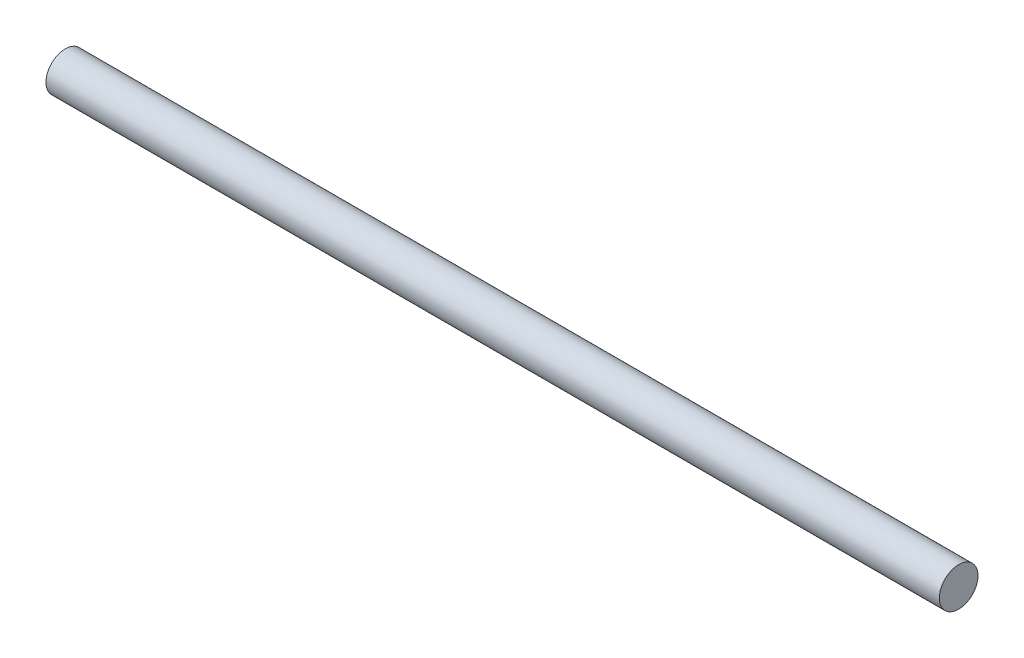
ISO-10303-21;
HEADER;
FILE_DESCRIPTION(('STEP AP214'),'2;1');
FILE_NAME('part.step','',(''),(''),'','','');
FILE_SCHEMA(('AUTOMOTIVE_DESIGN { 1 0 10303 214 1 1 1 1 }'));
ENDSEC;
DATA;
#1=APPLICATION_CONTEXT('core data for automotive mechanical design processes');
#2=APPLICATION_PROTOCOL_DEFINITION('international standard','automotive_design',2000,#1);
#3=PRODUCT_CONTEXT('',#1,'mechanical');
#4=PRODUCT('Part','Part','',(#3));
#5=PRODUCT_RELATED_PRODUCT_CATEGORY('part','',(#4));
#6=PRODUCT_DEFINITION_FORMATION('','',#4);
#7=PRODUCT_DEFINITION_CONTEXT('part definition',#1,'design');
#8=PRODUCT_DEFINITION('design','',#6,#7);
#9=PRODUCT_DEFINITION_SHAPE('','',#8);
#10=(LENGTH_UNIT() NAMED_UNIT(*) SI_UNIT(.MILLI.,.METRE.));
#11=(NAMED_UNIT(*) PLANE_ANGLE_UNIT() SI_UNIT($,.RADIAN.));
#12=(NAMED_UNIT(*) SI_UNIT($,.STERADIAN.) SOLID_ANGLE_UNIT());
#13=UNCERTAINTY_MEASURE_WITH_UNIT(LENGTH_MEASURE(1.E-05),#10,'distance_accuracy_value','');
#14=(GEOMETRIC_REPRESENTATION_CONTEXT(3) GLOBAL_UNCERTAINTY_ASSIGNED_CONTEXT((#13)) GLOBAL_UNIT_ASSIGNED_CONTEXT((#10,
#11,#12)) REPRESENTATION_CONTEXT('',''));
#15=CARTESIAN_POINT('',(0.,0.,0.));
#16=DIRECTION('',(0.,0.,1.));
#17=DIRECTION('',(1.,0.,0.));
#18=AXIS2_PLACEMENT_3D('',#15,#16,#17);
#19=CARTESIAN_POINT('',(0.,0.,0.));
#20=DIRECTION('',(1.,0.,0.));
#21=DIRECTION('',(0.,0.,-1.));
#22=AXIS2_PLACEMENT_3D('',#19,#20,#21);
#23=PLANE('',#22);
#24=CARTESIAN_POINT('',(0.,0.,0.));
#25=DIRECTION('',(1.,0.,0.));
#26=DIRECTION('',(0.,0.,-1.));
#27=AXIS2_PLACEMENT_3D('',#24,#25,#26);
#28=CIRCLE('',#27,5.);
#29=CARTESIAN_POINT('',(0.,0.,-5.));
#30=VERTEX_POINT('',#29);
#31=EDGE_CURVE('E45',#30,#30,#28,.T.);
#32=ORIENTED_EDGE('',*,*,#31,.F.);
#33=EDGE_LOOP('',(#32));
#34=FACE_BOUND('',#33,.T.);
#35=ADVANCED_FACE('F38',(#34),#23,.F.);
#36=CARTESIAN_POINT('',(231.,0.,0.));
#37=DIRECTION('',(1.,0.,0.));
#38=DIRECTION('',(0.,0.,-1.));
#39=AXIS2_PLACEMENT_3D('',#36,#37,#38);
#40=PLANE('',#39);
#41=CARTESIAN_POINT('',(231.,0.,0.));
#42=DIRECTION('',(1.,0.,0.));
#43=DIRECTION('',(0.,0.,-1.));
#44=AXIS2_PLACEMENT_3D('',#41,#42,#43);
#45=CIRCLE('',#44,5.);
#46=CARTESIAN_POINT('',(231.,0.,-5.));
#47=VERTEX_POINT('',#46);
#48=EDGE_CURVE('E12',#47,#47,#45,.T.);
#49=ORIENTED_EDGE('',*,*,#48,.T.);
#50=EDGE_LOOP('',(#49));
#51=FACE_BOUND('',#50,.T.);
#52=ADVANCED_FACE('F52',(#51),#40,.T.);
#53=CARTESIAN_POINT('',(0.,0.,0.));
#54=DIRECTION('',(1.,0.,0.));
#55=DIRECTION('',(0.,0.,-1.));
#56=AXIS2_PLACEMENT_3D('',#53,#54,#55);
#57=CYLINDRICAL_SURFACE('',#56,5.);
#58=ORIENTED_EDGE('',*,*,#48,.F.);
#59=EDGE_LOOP('',(#58));
#60=FACE_BOUND('',#59,.T.);
#61=ORIENTED_EDGE('',*,*,#31,.T.);
#62=EDGE_LOOP('',(#61));
#63=FACE_BOUND('',#62,.T.);
#64=ADVANCED_FACE('F54',(#60,#63),#57,.T.);
#65=CLOSED_SHELL('',(#35,#52,#64));
#66=MANIFOLD_SOLID_BREP('B2',#65);
#67=ADVANCED_BREP_SHAPE_REPRESENTATION('',(#18,#66),#14);
#68=SHAPE_DEFINITION_REPRESENTATION(#9,#67);
ENDSEC;
END-ISO-10303-21;
